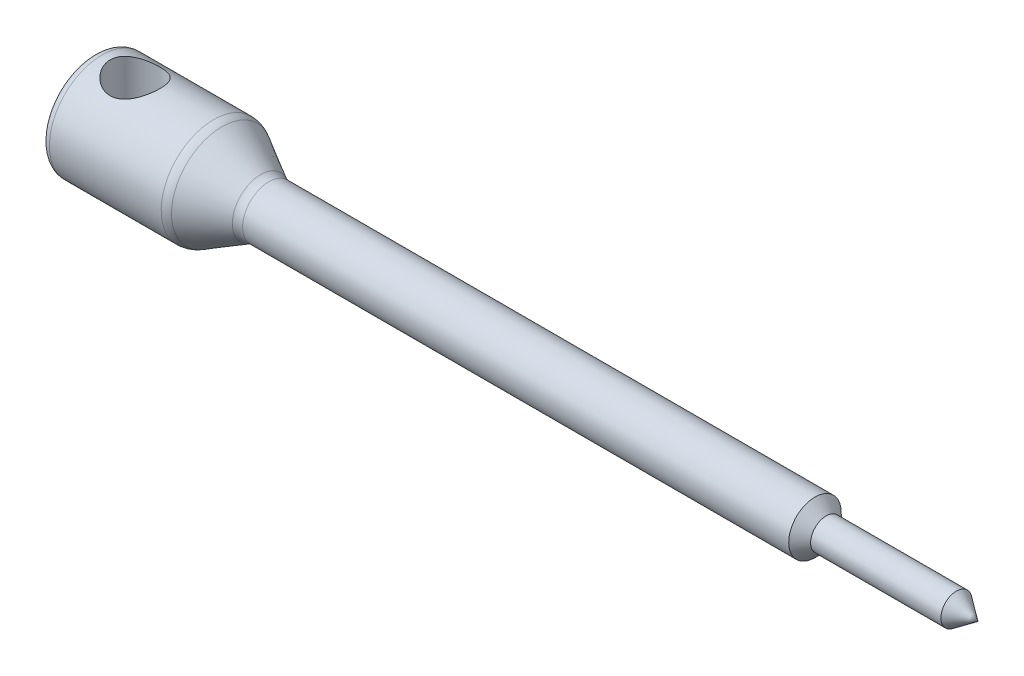
ISO-10303-21;
HEADER;
FILE_DESCRIPTION(('STEP AP214'),'2;1');
FILE_NAME('part.step','',(''),(''),'','','');
FILE_SCHEMA(('AUTOMOTIVE_DESIGN { 1 0 10303 214 1 1 1 1 }'));
ENDSEC;
DATA;
#1=APPLICATION_CONTEXT('core data for automotive mechanical design processes');
#2=APPLICATION_PROTOCOL_DEFINITION('international standard','automotive_design',2000,#1);
#3=PRODUCT_CONTEXT('',#1,'mechanical');
#4=PRODUCT('Part','Part','',(#3));
#5=PRODUCT_RELATED_PRODUCT_CATEGORY('part','',(#4));
#6=PRODUCT_DEFINITION_FORMATION('','',#4);
#7=PRODUCT_DEFINITION_CONTEXT('part definition',#1,'design');
#8=PRODUCT_DEFINITION('design','',#6,#7);
#9=PRODUCT_DEFINITION_SHAPE('','',#8);
#10=(LENGTH_UNIT() NAMED_UNIT(*) SI_UNIT(.MILLI.,.METRE.));
#11=(NAMED_UNIT(*) PLANE_ANGLE_UNIT() SI_UNIT($,.RADIAN.));
#12=(NAMED_UNIT(*) SI_UNIT($,.STERADIAN.) SOLID_ANGLE_UNIT());
#13=UNCERTAINTY_MEASURE_WITH_UNIT(LENGTH_MEASURE(1.E-05),#10,'distance_accuracy_value','');
#14=(GEOMETRIC_REPRESENTATION_CONTEXT(3) GLOBAL_UNCERTAINTY_ASSIGNED_CONTEXT((#13)) GLOBAL_UNIT_ASSIGNED_CONTEXT((#10,
#11,#12)) REPRESENTATION_CONTEXT('',''));
#15=CARTESIAN_POINT('',(0.,0.,0.));
#16=DIRECTION('',(0.,0.,1.));
#17=DIRECTION('',(1.,0.,0.));
#18=AXIS2_PLACEMENT_3D('',#15,#16,#17);
#19=CARTESIAN_POINT('',(106.6,0.,0.));
#20=DIRECTION('',(1.,0.,0.));
#21=DIRECTION('',(0.,1.,0.));
#22=AXIS2_PLACEMENT_3D('',#19,#20,#21);
#23=CYLINDRICAL_SURFACE('',#22,6.325);
#24=CARTESIAN_POINT('',(14.4746490935962,0.,0.));
#25=DIRECTION('',(-1.,0.,0.));
#26=DIRECTION('',(0.,-1.,0.));
#27=AXIS2_PLACEMENT_3D('',#24,#25,#26);
#28=CIRCLE('',#27,6.325);
#29=CARTESIAN_POINT('',(14.4746490935962,-6.325,0.));
#30=VERTEX_POINT('',#29);
#31=EDGE_CURVE('E11',#30,#30,#28,.T.);
#32=ORIENTED_EDGE('',*,*,#31,.T.);
#33=EDGE_LOOP('',(#32));
#34=FACE_BOUND('',#33,.T.);
#35=CARTESIAN_POINT('',(1.,0.,0.));
#36=DIRECTION('',(-1.,0.,0.));
#37=DIRECTION('',(0.,-1.,0.));
#38=AXIS2_PLACEMENT_3D('',#35,#36,#37);
#39=CIRCLE('',#38,6.325);
#40=CARTESIAN_POINT('',(1.,-6.325,0.));
#41=VERTEX_POINT('',#40);
#42=EDGE_CURVE('E89',#41,#41,#39,.F.);
#43=ORIENTED_EDGE('',*,*,#42,.T.);
#44=EDGE_LOOP('',(#43));
#45=FACE_BOUND('',#44,.T.);
#46=CARTESIAN_POINT('',(5.,-5.56826947982944,-3.));
#47=CARTESIAN_POINT('',(4.92119222967104,-5.56827059392074,-2.99999894259012));
#48=CARTESIAN_POINT('',(4.8423674233433,-5.56995022733211,-2.99688818333173));
#49=CARTESIAN_POINT('',(4.68533256394971,-5.57659934100432,-2.98449399086385));
#50=CARTESIAN_POINT('',(4.60712285760096,-5.58157055855336,-2.97520729800386));
#51=CARTESIAN_POINT('',(4.37406418742015,-5.60121077340082,-2.93818095629581));
#52=CARTESIAN_POINT('',(4.22095489226827,-5.62060579276863,-2.90127534083909));
#53=CARTESIAN_POINT('',(3.92468410004388,-5.6692638034737,-2.80497957289879));
#54=CARTESIAN_POINT('',(3.78147784216927,-5.69847834164824,-2.7456996503619));
#55=CARTESIAN_POINT('',(3.50704313818055,-5.76339840148072,-2.6066719292384));
#56=CARTESIAN_POINT('',(3.37581426197858,-5.79910368992877,-2.52692486598507));
#57=CARTESIAN_POINT('',(3.11838132271694,-5.87621576218045,-2.34231156048667));
#58=CARTESIAN_POINT('',(2.99326342353009,-5.91784886026107,-2.23602553085196));
#59=CARTESIAN_POINT('',(2.76179540175121,-6.00028965082854,-2.00431342156703));
#60=CARTESIAN_POINT('',(2.65545387826204,-6.04109695758843,-1.87887862104671));
#61=CARTESIAN_POINT('',(2.45842120369391,-6.12018128310053,-1.60334416695812));
#62=CARTESIAN_POINT('',(2.36902853095926,-6.15816567959753,-1.45222420558039));
#63=CARTESIAN_POINT('',(2.21742304273379,-6.22444335837359,-1.13495446838355));
#64=CARTESIAN_POINT('',(2.15519475287613,-6.25274215612739,-0.968813314772511));
#65=CARTESIAN_POINT('',(2.06386288193791,-6.29483875977189,-0.637685698725659));
#66=CARTESIAN_POINT('',(2.03286625238469,-6.30946080268784,-0.473328463536841));
#67=CARTESIAN_POINT('',(1.99868128341978,-6.32560646409969,-0.141143034605315));
#68=CARTESIAN_POINT('',(1.99547801021746,-6.32713711679121,0.0266832465662504));
#69=CARTESIAN_POINT('',(2.01615387853978,-6.31734976099337,0.346966074304831));
#70=CARTESIAN_POINT('',(2.03792823608613,-6.30703025411388,0.499595554410272));
#71=CARTESIAN_POINT('',(2.10422671587661,-6.27616682010759,0.798730827608391));
#72=CARTESIAN_POINT('',(2.14875252967634,-6.25562213274838,0.945236164498804));
#73=CARTESIAN_POINT('',(2.25968236864464,-6.20584246781492,1.23063265997631));
#74=CARTESIAN_POINT('',(2.32639902524351,-6.17648392957829,1.36937985878915));
#75=CARTESIAN_POINT('',(2.47943819716109,-6.11179613579103,1.63406367426613));
#76=CARTESIAN_POINT('',(2.56576788753176,-6.07646469638256,1.75999557822771));
#77=CARTESIAN_POINT('',(2.76427066135492,-5.99958521327416,2.00718314210621));
#78=CARTESIAN_POINT('',(2.87804137206861,-5.9577637337292,2.12707218128263));
#79=CARTESIAN_POINT('',(3.12385932421293,-5.87470422846713,2.34676308430842));
#80=CARTESIAN_POINT('',(3.25591811580817,-5.83346658977115,2.4465521551271));
#81=CARTESIAN_POINT('',(3.54315872541268,-5.75395600368514,2.62830401957828));
#82=CARTESIAN_POINT('',(3.69919233712724,-5.71595380516626,2.7090502998139));
#83=CARTESIAN_POINT('',(4.02488709858034,-5.65076578326242,2.8425427787134));
#84=CARTESIAN_POINT('',(4.19453514105959,-5.62356970297142,2.89531554513415));
#85=CARTESIAN_POINT('',(4.5289997118452,-5.58587662174924,2.96734767561627));
#86=CARTESIAN_POINT('',(4.69320431620829,-5.57426803608066,2.98884830804172));
#87=CARTESIAN_POINT('',(5.02324984478771,-5.5658799958538,3.0044480969795));
#88=CARTESIAN_POINT('',(5.18908980006437,-5.56909223162059,2.99856260820962));
#89=CARTESIAN_POINT('',(5.50122605010283,-5.58881180328484,2.96161295038339));
#90=CARTESIAN_POINT('',(5.64789964097414,-5.60404769648067,2.93295494845039));
#91=CARTESIAN_POINT('',(5.9341334480049,-5.644300124394,2.85471913635692));
#92=CARTESIAN_POINT('',(6.07369160588337,-5.66931947122875,2.80513531103538));
#93=CARTESIAN_POINT('',(6.34902070999583,-5.72769745099554,2.68399142659994));
#94=CARTESIAN_POINT('',(6.48431830405433,-5.76138813885599,2.61152137333991));
#95=CARTESIAN_POINT('',(6.74158315374771,-5.83296135507246,2.44748641547256));
#96=CARTESIAN_POINT('',(6.86354369375344,-5.87084597606294,2.35591195805711));
#97=CARTESIAN_POINT('',(7.10482182301408,-5.95160212866338,2.14435001701812));
#98=CARTESIAN_POINT('',(7.22234194249414,-5.99456026656037,2.02233658866698));
#99=CARTESIAN_POINT('',(7.43572594154971,-6.07689765760572,1.75951528411057));
#100=CARTESIAN_POINT('',(7.53158469974223,-6.11627606308742,1.61870297578957));
#101=CARTESIAN_POINT('',(7.70016980839589,-6.18794082486986,1.31877084024751));
#102=CARTESIAN_POINT('',(7.77247318100967,-6.22009458943288,1.15937944435881));
#103=CARTESIAN_POINT('',(7.88856776697291,-6.27269871970996,0.828739132863058));
#104=CARTESIAN_POINT('',(7.93238147081069,-6.2931583155585,0.657499688866359));
#105=CARTESIAN_POINT('',(7.98684330765157,-6.31872953003334,0.323827411524828));
#106=CARTESIAN_POINT('',(8.00000574668265,-6.32500334618504,0.161892570167804));
#107=CARTESIAN_POINT('',(7.99999425398486,-6.32499665430743,-0.161954081571034));
#108=CARTESIAN_POINT('',(7.98682778594961,-6.31871970415749,-0.323865885471267));
#109=CARTESIAN_POINT('',(7.93627602883782,-6.29498930664524,-0.633692315519093));
#110=CARTESIAN_POINT('',(7.9002709682672,-6.27817342180405,-0.781885743577601));
#111=CARTESIAN_POINT('',(7.80680442790054,-6.23554743092223,-1.06994859736248));
#112=CARTESIAN_POINT('',(7.74933955680514,-6.20973590334094,-1.20981670338353));
#113=CARTESIAN_POINT('',(7.61181180518672,-6.15005522255023,-1.48426989111478));
#114=CARTESIAN_POINT('',(7.53084894244308,-6.11587592942774,-1.6183345797961));
#115=CARTESIAN_POINT('',(7.3497897808953,-6.0432002838394,-1.87156021352395));
#116=CARTESIAN_POINT('',(7.24968477148527,-6.00470196931824,-1.99071433254137));
#117=CARTESIAN_POINT('',(7.02268724281229,-5.92323064689877,-2.22200871337881));
#118=CARTESIAN_POINT('',(6.89419299061268,-5.88016723357338,-2.33254702006946));
#119=CARTESIAN_POINT('',(6.61947312884743,-5.79751874033787,-2.53100624303766));
#120=CARTESIAN_POINT('',(6.47323445105551,-5.75793626148665,-2.61891033933674));
#121=CARTESIAN_POINT('',(6.24184842402669,-5.70456145379904,-2.73228661775989));
#122=CARTESIAN_POINT('',(6.16193833942879,-5.68764521759227,-2.76722730365996));
#123=CARTESIAN_POINT('',(5.998919126808,-5.65659583143465,-2.83015556897132));
#124=CARTESIAN_POINT('',(5.91581165684595,-5.6424612616503,-2.85814669753253));
#125=CARTESIAN_POINT('',(5.7472232882831,-5.61756472370398,-2.90677436061479));
#126=CARTESIAN_POINT('',(5.66174920835035,-5.60679398136672,-2.92743004847765));
#127=CARTESIAN_POINT('',(5.48897911797295,-5.58903897873491,-2.96118815374418));
#128=CARTESIAN_POINT('',(5.40168447372224,-5.58205197819102,-2.97429603783074));
#129=CARTESIAN_POINT('',(5.261817417597,-5.57417824399279,-2.9890126618239));
#130=CARTESIAN_POINT('',(5.20956869135898,-5.57196614417567,-2.99313013945517));
#131=CARTESIAN_POINT('',(5.10488249811636,-5.56901135292521,-2.99862423213567));
#132=CARTESIAN_POINT('',(5.05244502137411,-5.56826873842358,-3.00000070368549));
#133=CARTESIAN_POINT('',(5.,-5.56826947982944,-3.));
#134=B_SPLINE_CURVE_WITH_KNOTS('',3,(#46,#47,#48,#49,#50,#51,#52,#53,#54,#55,#56,#57,#58,#59,
#60,#61,#62,#63,#64,#65,#66,#67,#68,#69,#70,#71,#72,#73,#74,#75,#76,#77,#78,#79,#80,#81,#82,#83,
#84,#85,#86,#87,#88,#89,#90,#91,#92,#93,#94,#95,#96,#97,#98,#99,#100,#101,#102,#103,#104,#105,
#106,#107,#108,#109,#110,#111,#112,#113,#114,#115,#116,#117,#118,#119,#120,#121,#122,#123,#124,
#125,#126,#127,#128,#129,#130,#131,#132,#133),.UNSPECIFIED.,.T.,.F.,(4,2,2,2,2,2,2,2,2,2,2,2,2,
2,2,2,2,2,2,2,2,2,2,2,2,2,2,2,2,2,2,2,2,2,2,2,2,2,2,2,2,2,2,4),(0.,0.23636561517253,
0.472856082954266,0.946337594194861,1.41751625661757,1.88867799313591,2.39462310052555,
2.90079932028096,3.43692840139747,3.9727516732838,4.4736852685099,4.97434968786119,
5.43573919158286,5.89716300429919,6.36538417920483,6.83377692045143,7.34303611918456,
7.85261842908479,8.38905438552313,8.92497994659177,9.42019481438097,9.91513206096266,
10.3637831055551,10.8125632035357,11.2820905099279,11.7518531600233,12.2737820077344,
12.7958341259675,13.3268011505475,13.8573485053749,14.3425559887278,14.8276259454222,
15.2858589991811,15.7441644982919,16.2230789701406,16.7022118921722,17.2245602934014,
17.7472957501571,18.0135091811639,18.2795863755915,18.5449636256192,18.8101484270879,
18.967436861503,19.1247335301955),.UNSPECIFIED.);
#135=CARTESIAN_POINT('',(5.,-5.56826947982944,-3.));
#136=VERTEX_POINT('',#135);
#137=EDGE_CURVE('E128',#136,#136,#134,.T.);
#138=ORIENTED_EDGE('',*,*,#137,.T.);
#139=EDGE_LOOP('',(#138));
#140=FACE_BOUND('',#139,.T.);
#141=CARTESIAN_POINT('',(2.,6.325,0.));
#142=CARTESIAN_POINT('',(2.00000101495922,6.32499921054987,-0.07937328583606));
#143=CARTESIAN_POINT('',(2.00315616500706,6.32350063537498,-0.158762274405508));
#144=CARTESIAN_POINT('',(2.01573152342123,6.31755171365224,-0.31694302465793));
#145=CARTESIAN_POINT('',(2.02515495176933,6.31309985001873,-0.395734458329656));
#146=CARTESIAN_POINT('',(2.06274328864522,6.29543998740824,-0.630563530451089));
#147=CARTESIAN_POINT('',(2.10022601987851,6.27792800725696,-0.784905940155577));
#148=CARTESIAN_POINT('',(2.19820364720494,6.23328312699633,-1.08380902595234));
#149=CARTESIAN_POINT('',(2.258612327413,6.20618629753549,-1.22840398831555));
#150=CARTESIAN_POINT('',(2.40030961989093,6.14491141751232,-1.50525386061078));
#151=CARTESIAN_POINT('',(2.48159516207826,6.1107344082807,-1.63751058106886));
#152=CARTESIAN_POINT('',(2.66795701925113,6.03625383618954,-1.89423559545804));
#153=CARTESIAN_POINT('',(2.77411144503212,5.99571424981955,-2.01785184257788));
#154=CARTESIAN_POINT('',(3.00485826777346,5.91392876173544,-2.24628973254667));
#155=CARTESIAN_POINT('',(3.12946311806683,5.87268239973268,-2.35109857460012));
#156=CARTESIAN_POINT('',(3.40390384238563,5.79093548110996,-2.54610148878998));
#157=CARTESIAN_POINT('',(3.55487865679303,5.75067590563505,-2.63481919590593));
#158=CARTESIAN_POINT('',(3.79232351265093,5.69720377714499,-2.74758542527731));
#159=CARTESIAN_POINT('',(3.87333262498362,5.68052796563149,-2.78179755873313));
#160=CARTESIAN_POINT('',(4.03851082135988,5.65008974824633,-2.84311152705235));
#161=CARTESIAN_POINT('',(4.12267809015688,5.63632569806092,-2.87021737701754));
#162=CARTESIAN_POINT('',(4.28872255163548,5.61294652033182,-2.91565996550161));
#163=CARTESIAN_POINT('',(4.37046155709498,5.60314131539768,-2.9344047536129));
#164=CARTESIAN_POINT('',(4.53551938204417,5.58700514058788,-2.96501236144485));
#165=CARTESIAN_POINT('',(4.61883737983741,5.58067241237926,-2.97687866434861));
#166=CARTESIAN_POINT('',(4.78634271946731,5.57174036269458,-2.99356430842584));
#167=CARTESIAN_POINT('',(4.87052963290727,5.56913928241007,-2.99838696944335));
#168=CARTESIAN_POINT('',(5.03901481625039,5.56776703011237,-3.00093114109715));
#169=CARTESIAN_POINT('',(5.12331307677214,5.56899555374532,-2.99865321604527));
#170=CARTESIAN_POINT('',(5.35758013660381,5.57772992265056,-2.98240817484294));
#171=CARTESIAN_POINT('',(5.50693930410414,5.58942032616689,-2.96064281095207));
#172=CARTESIAN_POINT('',(5.79946528752883,5.62348263868996,-2.89540594871321));
#173=CARTESIAN_POINT('',(5.94263042298308,5.64585742684652,-2.85192859943351));
#174=CARTESIAN_POINT('',(6.22284238788815,5.69926319319761,-2.74367138632386));
#175=CARTESIAN_POINT('',(6.35967030376834,5.73048289925907,-2.67842083890667));
#176=CARTESIAN_POINT('',(6.62105093601606,5.79805556291057,-2.52881460000707));
#177=CARTESIAN_POINT('',(6.745598202297,5.83441078235834,-2.44445048030632));
#178=CARTESIAN_POINT('',(6.99365464386333,5.9131145898616,-2.24791252177869));
#179=CARTESIAN_POINT('',(7.11546807197926,5.95567711073127,-2.13367701576747));
#180=CARTESIAN_POINT('',(7.33887108019237,6.03863976360999,-1.88613177624688));
#181=CARTESIAN_POINT('',(7.44045277505848,6.07903904803931,-1.75281464040968));
#182=CARTESIAN_POINT('',(7.62407270985824,6.15500803288284,-1.46442333675612));
#183=CARTESIAN_POINT('',(7.70522408295291,6.19033658769695,-1.30871596562321));
#184=CARTESIAN_POINT('',(7.8395553892661,6.25020517847367,-0.983754466666571));
#185=CARTESIAN_POINT('',(7.89275539374979,6.27475295379323,-0.814510160321685));
#186=CARTESIAN_POINT('',(7.96567052832049,6.30871422860522,-0.481264133657539));
#187=CARTESIAN_POINT('',(7.98764848436719,6.31914748472658,-0.317862112465461));
#188=CARTESIAN_POINT('',(8.0044799188396,6.32712085065144,0.0106208024948185));
#189=CARTESIAN_POINT('',(7.99934441723275,6.32466619860608,0.175700986967558));
#190=CARTESIAN_POINT('',(7.96351740046221,6.30776099534971,0.490932176851729));
#191=CARTESIAN_POINT('',(7.93459072837709,6.29413905953025,0.641334091225897));
#192=CARTESIAN_POINT('',(7.85466768972812,6.25727572263287,0.934891454392057));
#193=CARTESIAN_POINT('',(7.80366877465421,6.23403321075546,1.07804606426162));
#194=CARTESIAN_POINT('',(7.67954323153749,6.17919004017601,1.35801790632853));
#195=CARTESIAN_POINT('',(7.60579279175533,6.1473574086089,1.49451155811569));
#196=CARTESIAN_POINT('',(7.43894236599483,6.07851077391321,1.75366442375865));
#197=CARTESIAN_POINT('',(7.34583389688093,6.04149450152289,1.87631753589401));
#198=CARTESIAN_POINT('',(7.133168910347,5.96200056350037,2.11601571661925));
#199=CARTESIAN_POINT('',(7.01198380312117,5.91933151049151,2.23155556216531));
#200=CARTESIAN_POINT('',(6.75163263228626,5.83597829959665,2.44125850892367));
#201=CARTESIAN_POINT('',(6.61245721112641,5.79529518996547,2.53541041455941));
#202=CARTESIAN_POINT('',(6.31361783408067,5.71923443822342,2.70273043671851));
#203=CARTESIAN_POINT('',(6.15339850976286,5.68409906958169,2.77502600142352));
#204=CARTESIAN_POINT('',(5.82084631774221,5.62607963345705,2.89086823854941));
#205=CARTESIAN_POINT('',(5.6485276340492,5.60318148293857,2.93444797171417));
#206=CARTESIAN_POINT('',(5.31365007097895,5.57483397381238,2.98792303183246));
#207=CARTESIAN_POINT('',(5.15164639875423,5.56797639828486,3.00054213984495));
#208=CARTESIAN_POINT('',(4.82778091895189,5.56858156250485,2.9994225916428));
#209=CARTESIAN_POINT('',(4.66591908297926,5.57603986861128,2.98569209592382));
#210=CARTESIAN_POINT('',(4.36010191642111,5.60300296768132,2.93473990028628));
#211=CARTESIAN_POINT('',(4.21573230320013,5.62152700143465,2.89942581708128));
#212=CARTESIAN_POINT('',(3.93505413850971,5.6674982341567,2.80849930713924));
#213=CARTESIAN_POINT('',(3.79874803506356,5.69494812668635,2.75288075248913));
#214=CARTESIAN_POINT('',(3.52805556671751,5.75792936593568,2.61872212533421));
#215=CARTESIAN_POINT('',(3.39440415219412,5.79387773243907,2.53890024838445));
#216=CARTESIAN_POINT('',(3.14155507604513,5.86897262427893,2.36012226089958));
#217=CARTESIAN_POINT('',(3.02236442055091,5.90812068459247,2.26115693526748));
#218=CARTESIAN_POINT('',(2.78885361457309,5.99012595815152,2.0346980743859));
#219=CARTESIAN_POINT('',(2.67635931387515,6.03294096928713,1.90530007407234));
#220=CARTESIAN_POINT('',(2.47433833731994,6.11359076968122,1.62800810323697));
#221=CARTESIAN_POINT('',(2.38482283230134,6.15142313235565,1.48010518856395));
#222=CARTESIAN_POINT('',(2.27029971097628,6.20126841880405,1.24748319611567));
#223=CARTESIAN_POINT('',(2.2354371234724,6.21672332071643,1.16821591170853));
#224=CARTESIAN_POINT('',(2.17257175193905,6.24493245782113,1.00655655346354));
#225=CARTESIAN_POINT('',(2.14456562823048,6.25768800741464,0.924166023586352));
#226=CARTESIAN_POINT('',(2.09579531287352,6.28009258093229,0.757071001051431));
#227=CARTESIAN_POINT('',(2.0750145571098,6.28974870630825,0.672372287494199));
#228=CARTESIAN_POINT('',(2.04088142249416,6.30569412533461,0.501220438604927));
#229=CARTESIAN_POINT('',(2.02752420932811,6.31198560998483,0.41476848312294));
#230=CARTESIAN_POINT('',(2.01198725877617,6.31932115504729,0.273451008841696));
#231=CARTESIAN_POINT('',(2.00749482184513,6.32144803339127,0.218883750436739));
#232=CARTESIAN_POINT('',(2.00150080844935,6.32428774424899,0.109546823947194));
#233=CARTESIAN_POINT('',(1.99999929955559,6.32500054481591,0.0547771513176751));
#234=CARTESIAN_POINT('',(2.,6.325,0.));
#235=B_SPLINE_CURVE_WITH_KNOTS('',3,(#141,#142,#143,#144,#145,#146,#147,#148,#149,#150,#151,
#152,#153,#154,#155,#156,#157,#158,#159,#160,#161,#162,#163,#164,#165,#166,#167,#168,#169,#170,
#171,#172,#173,#174,#175,#176,#177,#178,#179,#180,#181,#182,#183,#184,#185,#186,#187,#188,#189,
#190,#191,#192,#193,#194,#195,#196,#197,#198,#199,#200,#201,#202,#203,#204,#205,#206,#207,#208,
#209,#210,#211,#212,#213,#214,#215,#216,#217,#218,#219,#220,#221,#222,#223,#224,#225,#226,#227,
#228,#229,#230,#231,#232,#233,#234),.UNSPECIFIED.,.T.,.F.,(4,2,2,2,2,2,2,2,2,2,2,2,2,2,2,2,2,2,
2,2,2,2,2,2,2,2,2,2,2,2,2,2,2,2,2,2,2,2,2,2,2,2,2,2,2,2,4),(0.,0.238061711995977,
0.476245809586168,0.95305791656634,1.42809440052183,1.90306106713573,2.4046497721108,
2.9065785867478,3.44260246693829,3.71080289663289,3.97885146295571,4.23179643176775,
4.48461320010641,4.73731077110231,4.98998825972909,5.44182643516032,5.89378643740736,
6.35622878305538,6.81887544305785,7.3336121916173,7.84854916571078,8.38300710737338,
8.91708074015982,9.41003253065641,9.90278398173288,10.3619666330092,10.8212023166815,
11.29435678893,11.7677190470957,12.2838036112782,12.8001577020385,13.3350096219711,
13.8692446820868,14.3544617265665,14.839528523148,15.2869159432452,15.7344384971598,
16.2118217775178,16.6894354306873,17.2172044238399,17.7452295011152,18.0088189159429,
18.2722796837933,18.5351324241611,18.7978137899978,18.9621014049871,19.1263927315158),.UNSPECIFIED.);
#236=CARTESIAN_POINT('',(2.,6.325,0.));
#237=VERTEX_POINT('',#236);
#238=EDGE_CURVE('E124',#237,#237,#235,.T.);
#239=ORIENTED_EDGE('',*,*,#238,.T.);
#240=EDGE_LOOP('',(#239));
#241=FACE_BOUND('',#240,.T.);
#242=ADVANCED_FACE('F32',(#34,#45,#140,#241),#23,.T.);
#243=CARTESIAN_POINT('',(106.6,0.,0.));
#244=DIRECTION('',(-1.,0.,0.));
#245=DIRECTION('',(0.,-1.,0.));
#246=AXIS2_PLACEMENT_3D('',#243,#244,#245);
#247=CONICAL_SURFACE('',#246,0.,0.624782546501608);
#248=CARTESIAN_POINT('',(104.,0.,0.));
#249=DIRECTION('',(1.,0.,0.));
#250=DIRECTION('',(0.,1.,0.));
#251=AXIS2_PLACEMENT_3D('',#248,#249,#250);
#252=CIRCLE('',#251,1.875);
#253=CARTESIAN_POINT('',(104.,1.875,0.));
#254=VERTEX_POINT('',#253);
#255=EDGE_CURVE('E121',#254,#254,#252,.T.);
#256=ORIENTED_EDGE('',*,*,#255,.T.);
#257=EDGE_LOOP('',(#256));
#258=FACE_BOUND('',#257,.T.);
#259=CARTESIAN_POINT('',(106.6,0.,0.));
#260=VERTEX_POINT('',#259);
#261=VERTEX_LOOP('',#260);
#262=FACE_BOUND('',#261,.T.);
#263=ADVANCED_FACE('F47',(#258,#262),#247,.T.);
#264=CARTESIAN_POINT('',(106.6,0.,0.));
#265=DIRECTION('',(1.,0.,0.));
#266=DIRECTION('',(0.,1.,0.));
#267=AXIS2_PLACEMENT_3D('',#264,#265,#266);
#268=CYLINDRICAL_SURFACE('',#267,1.875);
#269=CARTESIAN_POINT('',(88.3,0.,0.));
#270=DIRECTION('',(1.,0.,0.));
#271=DIRECTION('',(0.,1.,0.));
#272=AXIS2_PLACEMENT_3D('',#269,#270,#271);
#273=CIRCLE('',#272,1.875);
#274=CARTESIAN_POINT('',(88.3,1.875,0.));
#275=VERTEX_POINT('',#274);
#276=EDGE_CURVE('E120',#275,#275,#273,.T.);
#277=ORIENTED_EDGE('',*,*,#276,.T.);
#278=EDGE_LOOP('',(#277));
#279=FACE_BOUND('',#278,.T.);
#280=ORIENTED_EDGE('',*,*,#255,.F.);
#281=EDGE_LOOP('',(#280));
#282=FACE_BOUND('',#281,.T.);
#283=ADVANCED_FACE('F49',(#279,#282),#268,.T.);
#284=CARTESIAN_POINT('',(88.3,0.,0.));
#285=DIRECTION('',(-1.,0.,0.));
#286=DIRECTION('',(0.,-1.,0.));
#287=AXIS2_PLACEMENT_3D('',#284,#285,#286);
#288=CONICAL_SURFACE('',#287,1.875,0.762674802555803);
#289=CARTESIAN_POINT('',(86.95,0.,0.));
#290=DIRECTION('',(1.,0.,0.));
#291=DIRECTION('',(0.,1.,0.));
#292=AXIS2_PLACEMENT_3D('',#289,#290,#291);
#293=CIRCLE('',#292,3.16499999999999);
#294=CARTESIAN_POINT('',(86.95,3.16499999999999,0.));
#295=VERTEX_POINT('',#294);
#296=EDGE_CURVE('E117',#295,#295,#293,.T.);
#297=ORIENTED_EDGE('',*,*,#296,.T.);
#298=EDGE_LOOP('',(#297));
#299=FACE_BOUND('',#298,.T.);
#300=ORIENTED_EDGE('',*,*,#276,.F.);
#301=EDGE_LOOP('',(#300));
#302=FACE_BOUND('',#301,.T.);
#303=ADVANCED_FACE('F56',(#299,#302),#288,.T.);
#304=CARTESIAN_POINT('',(106.6,0.,0.));
#305=DIRECTION('',(1.,0.,0.));
#306=DIRECTION('',(0.,1.,0.));
#307=AXIS2_PLACEMENT_3D('',#304,#305,#306);
#308=CYLINDRICAL_SURFACE('',#307,3.16499999999999);
#309=CARTESIAN_POINT('',(21.1253509064038,0.,0.));
#310=DIRECTION('',(1.,0.,0.));
#311=DIRECTION('',(0.,1.,0.));
#312=AXIS2_PLACEMENT_3D('',#309,#310,#311);
#313=CIRCLE('',#312,3.16499999999999);
#314=CARTESIAN_POINT('',(21.1253509064038,3.16499999999999,0.));
#315=VERTEX_POINT('',#314);
#316=EDGE_CURVE('E81',#315,#315,#313,.T.);
#317=ORIENTED_EDGE('',*,*,#316,.T.);
#318=EDGE_LOOP('',(#317));
#319=FACE_BOUND('',#318,.T.);
#320=ORIENTED_EDGE('',*,*,#296,.F.);
#321=EDGE_LOOP('',(#320));
#322=FACE_BOUND('',#321,.T.);
#323=ADVANCED_FACE('F98',(#319,#322),#308,.T.);
#324=CARTESIAN_POINT('',(20.6,0.,0.));
#325=DIRECTION('',(-1.,0.,0.));
#326=DIRECTION('',(0.,-1.,0.));
#327=AXIS2_PLACEMENT_3D('',#324,#325,#326);
#328=CONICAL_SURFACE('',#327,3.16499999999999,0.513744932201711);
#329=CARTESIAN_POINT('',(20.1424665363382,0.,0.));
#330=DIRECTION('',(-1.,0.,0.));
#331=DIRECTION('',(0.,-1.,0.));
#332=AXIS2_PLACEMENT_3D('',#329,#330,#331);
#333=CIRCLE('',#332,3.42317959735204);
#334=CARTESIAN_POINT('',(20.1424665363382,-3.42317959735204,0.));
#335=VERTEX_POINT('',#334);
#336=EDGE_CURVE('E44',#335,#335,#333,.T.);
#337=ORIENTED_EDGE('',*,*,#336,.T.);
#338=EDGE_LOOP('',(#337));
#339=FACE_BOUND('',#338,.T.);
#340=CARTESIAN_POINT('',(15.4575334636619,0.,0.));
#341=DIRECTION('',(1.,0.,0.));
#342=DIRECTION('',(0.,1.,0.));
#343=AXIS2_PLACEMENT_3D('',#340,#341,#342);
#344=CIRCLE('',#343,6.06682040264795);
#345=CARTESIAN_POINT('',(15.4575334636619,6.06682040264795,0.));
#346=VERTEX_POINT('',#345);
#347=EDGE_CURVE('E83',#346,#346,#344,.T.);
#348=ORIENTED_EDGE('',*,*,#347,.T.);
#349=EDGE_LOOP('',(#348));
#350=FACE_BOUND('',#349,.T.);
#351=ADVANCED_FACE('F94',(#339,#350),#328,.T.);
#352=CARTESIAN_POINT('',(0.,0.,0.));
#353=DIRECTION('',(-1.,0.,0.));
#354=DIRECTION('',(0.,-1.,0.));
#355=AXIS2_PLACEMENT_3D('',#352,#353,#354);
#356=PLANE('',#355);
#357=CARTESIAN_POINT('',(0.,0.,0.));
#358=DIRECTION('',(-1.,0.,0.));
#359=DIRECTION('',(0.,-1.,0.));
#360=AXIS2_PLACEMENT_3D('',#357,#358,#359);
#361=CIRCLE('',#360,1.5);
#362=CARTESIAN_POINT('',(0.,-1.5,0.));
#363=VERTEX_POINT('',#362);
#364=EDGE_CURVE('E150',#363,#363,#361,.T.);
#365=ORIENTED_EDGE('',*,*,#364,.F.);
#366=EDGE_LOOP('',(#365));
#367=FACE_BOUND('',#366,.T.);
#368=CARTESIAN_POINT('',(0.,0.,0.));
#369=DIRECTION('',(-1.,0.,0.));
#370=DIRECTION('',(0.,-1.,0.));
#371=AXIS2_PLACEMENT_3D('',#368,#369,#370);
#372=CIRCLE('',#371,5.325);
#373=CARTESIAN_POINT('',(0.,-5.325,0.));
#374=VERTEX_POINT('',#373);
#375=EDGE_CURVE('E84',#374,#374,#372,.T.);
#376=ORIENTED_EDGE('',*,*,#375,.T.);
#377=EDGE_LOOP('',(#376));
#378=FACE_BOUND('',#377,.T.);
#379=ADVANCED_FACE('F97',(#367,#378),#356,.T.);
#380=CARTESIAN_POINT('',(5.,10.,0.));
#381=DIRECTION('',(0.,-1.,0.));
#382=DIRECTION('',(0.,0.,-1.));
#383=AXIS2_PLACEMENT_3D('',#380,#381,#382);
#384=CYLINDRICAL_SURFACE('',#383,3.);
#385=CARTESIAN_POINT('',(2.,-1.5,0.));
#386=CARTESIAN_POINT('',(2.00000429892438,-1.49999504652421,-0.0788579444268502));
#387=CARTESIAN_POINT('',(2.00314263470365,-1.49374489031842,-0.157809899546344));
#388=CARTESIAN_POINT('',(2.01538765944264,-1.46902067948769,-0.313380352903344));
#389=CARTESIAN_POINT('',(2.0245056825662,-1.45052341050328,-0.389994130070445));
#390=CARTESIAN_POINT('',(2.04775580894937,-1.40220928707506,-0.538400317320674));
#391=CARTESIAN_POINT('',(2.06186841233694,-1.37243642362805,-0.61021020440872));
#392=CARTESIAN_POINT('',(2.09381335226358,-1.30264406795252,-0.747708925209898));
#393=CARTESIAN_POINT('',(2.11164539549712,-1.2626253836267,-0.813398240985089));
#394=CARTESIAN_POINT('',(2.15065612612907,-1.17072412577207,-0.941261726642864));
#395=CARTESIAN_POINT('',(2.17197201308694,-1.11827028114054,-1.00298281668316));
#396=CARTESIAN_POINT('',(2.21510044629885,-1.00421778112944,-1.11716916730047));
#397=CARTESIAN_POINT('',(2.23691335686448,-0.942612222341338,-1.16962737466015));
#398=CARTESIAN_POINT('',(2.28051573203979,-0.806274975714928,-1.26787800067542));
#399=CARTESIAN_POINT('',(2.30217219544802,-0.730895852481131,-1.31283800332746));
#400=CARTESIAN_POINT('',(2.34071031841519,-0.572448996020678,-1.38925234033604));
#401=CARTESIAN_POINT('',(2.35759538589515,-0.489386806915876,-1.4207163224495));
#402=CARTESIAN_POINT('',(2.38313199443287,-0.323002341867116,-1.46719866328288));
#403=CARTESIAN_POINT('',(2.39221592624429,-0.239993321898909,-1.48308878562066));
#404=CARTESIAN_POINT('',(2.40227165077208,-0.0720317433307844,-1.50064048996327));
#405=CARTESIAN_POINT('',(2.40325145985068,0.0129188113067325,-1.50231613255961));
#406=CARTESIAN_POINT('',(2.39733604614127,0.171429036473053,-1.49203093075844));
#407=CARTESIAN_POINT('',(2.39136854506979,0.245136046834576,-1.48167683930523));
#408=CARTESIAN_POINT('',(2.37385656899224,0.389582864059563,-1.4504097735854));
#409=CARTESIAN_POINT('',(2.36231031752335,0.460321717957974,-1.42949343584648));
#410=CARTESIAN_POINT('',(2.33468785380888,0.598843698848489,-1.37731467057901));
#411=CARTESIAN_POINT('',(2.31851239004002,0.666519598178683,-1.34582260067399));
#412=CARTESIAN_POINT('',(2.28344893577894,0.795951438885012,-1.273562531502));
#413=CARTESIAN_POINT('',(2.26455972829714,0.857704703400134,-1.2327903657187));
#414=CARTESIAN_POINT('',(2.22330263145071,0.98178187911484,-1.13709908236918));
#415=CARTESIAN_POINT('',(2.20079734644881,1.04318531036424,-1.08104168755392));
#416=CARTESIAN_POINT('',(2.15678565049389,1.15610312788635,-0.95933336811206));
#417=CARTESIAN_POINT('',(2.13527972061798,1.20761278805082,-0.893677884861428));
#418=CARTESIAN_POINT('',(2.09447019075554,1.30152849154459,-0.750774758747773));
#419=CARTESIAN_POINT('',(2.07531523756989,1.34340070866861,-0.673130387399113));
#420=CARTESIAN_POINT('',(2.04263178318136,1.41314554356451,-0.510699323233195));
#421=CARTESIAN_POINT('',(2.0290988158467,1.44102927752275,-0.425918364397914));
#422=CARTESIAN_POINT('',(2.01013499387847,1.47971310557502,-0.259149737491053));
#423=CARTESIAN_POINT('',(2.00412592548035,1.49173685362017,-0.177512295822489));
#424=CARTESIAN_POINT('',(1.99890479811344,1.50219709670173,-0.0131693999240273));
#425=CARTESIAN_POINT('',(1.99968951918022,1.5006400284592,0.0695355298048632));
#426=CARTESIAN_POINT('',(2.00763211619847,1.48468996737188,0.22684945797898));
#427=CARTESIAN_POINT('',(2.01429131467747,1.47130120090501,0.301589112074895));
#428=CARTESIAN_POINT('',(2.03266743027739,1.43364289215732,0.447610338452912));
#429=CARTESIAN_POINT('',(2.04438490498382,1.40937215031976,0.518891528536631));
#430=CARTESIAN_POINT('',(2.07223622879618,1.35000230035045,0.658332912674359));
#431=CARTESIAN_POINT('',(2.08848677345554,1.31461342482557,0.726345595508705));
#432=CARTESIAN_POINT('',(2.12384038523873,1.23433869653015,0.855692042548907));
#433=CARTESIAN_POINT('',(2.14294466649592,1.18944879810691,0.917022944664887));
#434=CARTESIAN_POINT('',(2.18437667995703,1.08635936200393,1.03765153393382));
#435=CARTESIAN_POINT('',(2.20683672734751,1.02728569733228,1.09615811672854));
#436=CARTESIAN_POINT('',(2.2510641258677,0.900112273083408,1.20278448167828));
#437=CARTESIAN_POINT('',(2.27283098899929,0.83200632172812,1.25089707856781));
#438=CARTESIAN_POINT('',(2.31423211690266,0.684534518740536,1.33756187171853));
#439=CARTESIAN_POINT('',(2.33371205616409,0.604783100858278,1.37553824370037));
#440=CARTESIAN_POINT('',(2.36638891558798,0.438734898637551,1.43712423890206));
#441=CARTESIAN_POINT('',(2.37959392667375,0.352446710299665,1.46075237380052));
#442=CARTESIAN_POINT('',(2.39657748461297,0.184634665672944,1.49079253120031));
#443=CARTESIAN_POINT('',(2.40113924802402,0.103448619847137,1.49863949460818));
#444=CARTESIAN_POINT('',(2.40251968037595,-0.0591706007467876,1.5010337315643));
#445=CARTESIAN_POINT('',(2.39934170560415,-0.140603653106793,1.49558676993486));
#446=CARTESIAN_POINT('',(2.38643206923385,-0.293225252300156,1.47288918838996));
#447=CARTESIAN_POINT('',(2.37735358276012,-0.36465070521711,1.45681247151455));
#448=CARTESIAN_POINT('',(2.35443475718521,-0.50371217913655,1.41476303733662));
#449=CARTESIAN_POINT('',(2.34059288645497,-0.571346973138048,1.38878713673988));
#450=CARTESIAN_POINT('',(2.30857204453196,-0.705937276479806,1.32572361795085));
#451=CARTESIAN_POINT('',(2.29016416406119,-0.772541852743543,1.28800670672355));
#452=CARTESIAN_POINT('',(2.25147002547709,-0.898911804271889,1.20322645745609));
#453=CARTESIAN_POINT('',(2.23118279306584,-0.958673595781668,1.15615825686234));
#454=CARTESIAN_POINT('',(2.18806515262862,-1.07721297353201,1.04730498999206));
#455=CARTESIAN_POINT('',(2.16522525040058,-1.13498865352544,0.984426634495891));
#456=CARTESIAN_POINT('',(2.12183371610104,-1.2393944751529,0.849232209349795));
#457=CARTESIAN_POINT('',(2.10128332060707,-1.28601860920486,0.776911084957796));
#458=CARTESIAN_POINT('',(2.06452985650194,-1.36685454406811,0.623897395174419));
#459=CARTESIAN_POINT('',(2.048358552591,-1.4009762538547,0.543149255665096));
#460=CARTESIAN_POINT('',(2.0224798805152,-1.45471225163611,0.37611315170713));
#461=CARTESIAN_POINT('',(2.01275414955398,-1.47436777020857,0.28984169938365));
#462=CARTESIAN_POINT('',(2.00456807129783,-1.49084611662861,0.168902919736342));
#463=CARTESIAN_POINT('',(2.00285951989624,-1.49427396129951,0.135242819162347));
#464=CARTESIAN_POINT('',(2.00057454534777,-1.49885199827113,0.0677275977076368));
#465=CARTESIAN_POINT('',(1.99999815344928,-1.50000212770531,0.0338724714699424));
#466=CARTESIAN_POINT('',(2.,-1.5,0.));
#467=B_SPLINE_CURVE_WITH_KNOTS('',3,(#385,#386,#387,#388,#389,#390,#391,#392,#393,#394,#395,
#396,#397,#398,#399,#400,#401,#402,#403,#404,#405,#406,#407,#408,#409,#410,#411,#412,#413,#414,
#415,#416,#417,#418,#419,#420,#421,#422,#423,#424,#425,#426,#427,#428,#429,#430,#431,#432,#433,
#434,#435,#436,#437,#438,#439,#440,#441,#442,#443,#444,#445,#446,#447,#448,#449,#450,#451,#452,
#453,#454,#455,#456,#457,#458,#459,#460,#461,#462,#463,#464,#465,#466),.UNSPECIFIED.,.T.,.F.,(4,
2,2,2,2,2,2,2,2,2,2,2,2,2,2,2,2,2,2,2,2,2,2,2,2,2,2,2,2,2,2,2,2,2,2,2,2,2,2,2,4),(0.,
0.236436386130439,0.473322224563797,0.709293233238448,0.945245640872352,1.19547263807713,
1.44588935648105,1.71572589646129,1.98536921847421,2.23887018210344,2.49212035993531,
2.71508568613981,2.93812205888518,3.16635360252731,3.39468781890333,3.65197412000818,
3.90938301898029,4.17874533321661,4.44789325368419,4.69474935707018,4.94148846767214,
5.16910359759183,5.39674382446397,5.63089284041848,5.86514176122509,6.12239415966628,
6.37982382923148,6.64972023242589,6.91926767918176,7.1629396125457,7.40650589797017,
7.62686895373284,7.84730293182527,8.08254685170431,8.31791341715446,8.58187864135757,
8.84598575071869,9.1119602049529,9.37717362931724,9.47872920200875,9.58028757766599),.UNSPECIFIED.);
#468=CARTESIAN_POINT('',(2.,-1.5,0.));
#469=VERTEX_POINT('',#468);
#470=EDGE_CURVE('E36',#469,#469,#467,.T.);
#471=ORIENTED_EDGE('',*,*,#470,.F.);
#472=EDGE_LOOP('',(#471));
#473=FACE_BOUND('',#472,.T.);
#474=ORIENTED_EDGE('',*,*,#238,.F.);
#475=EDGE_LOOP('',(#474));
#476=FACE_BOUND('',#475,.T.);
#477=ORIENTED_EDGE('',*,*,#137,.F.);
#478=EDGE_LOOP('',(#477));
#479=FACE_BOUND('',#478,.T.);
#480=ADVANCED_FACE('F67',(#473,#476,#479),#384,.F.);
#481=CARTESIAN_POINT('',(1.,0.,0.));
#482=DIRECTION('',(-1.,0.,0.));
#483=DIRECTION('',(0.,-1.,0.));
#484=AXIS2_PLACEMENT_3D('',#481,#482,#483);
#485=TOROIDAL_SURFACE('',#484,5.325,1.);
#486=ORIENTED_EDGE('',*,*,#375,.F.);
#487=EDGE_LOOP('',(#486));
#488=FACE_BOUND('',#487,.T.);
#489=ORIENTED_EDGE('',*,*,#42,.F.);
#490=EDGE_LOOP('',(#489));
#491=FACE_BOUND('',#490,.T.);
#492=ADVANCED_FACE('F64',(#488,#491),#485,.T.);
#493=CARTESIAN_POINT('',(21.1253509064038,0.,0.));
#494=DIRECTION('',(1.,0.,0.));
#495=DIRECTION('',(0.,1.,0.));
#496=AXIS2_PLACEMENT_3D('',#493,#494,#495);
#497=TOROIDAL_SURFACE('',#496,5.16499999999999,2.);
#498=ORIENTED_EDGE('',*,*,#336,.F.);
#499=EDGE_LOOP('',(#498));
#500=FACE_BOUND('',#499,.T.);
#501=ORIENTED_EDGE('',*,*,#316,.F.);
#502=EDGE_LOOP('',(#501));
#503=FACE_BOUND('',#502,.T.);
#504=ADVANCED_FACE('F66',(#500,#503),#497,.F.);
#505=CARTESIAN_POINT('',(14.4746490935962,0.,0.));
#506=DIRECTION('',(-1.,0.,0.));
#507=DIRECTION('',(0.,-1.,0.));
#508=AXIS2_PLACEMENT_3D('',#505,#506,#507);
#509=TOROIDAL_SURFACE('',#508,4.325,2.);
#510=ORIENTED_EDGE('',*,*,#31,.F.);
#511=EDGE_LOOP('',(#510));
#512=FACE_BOUND('',#511,.T.);
#513=ORIENTED_EDGE('',*,*,#347,.F.);
#514=EDGE_LOOP('',(#513));
#515=FACE_BOUND('',#514,.T.);
#516=ADVANCED_FACE('F34',(#512,#515),#509,.T.);
#517=CARTESIAN_POINT('',(6.,0.,0.));
#518=DIRECTION('',(-1.,0.,0.));
#519=DIRECTION('',(0.,-1.,0.));
#520=AXIS2_PLACEMENT_3D('',#517,#518,#519);
#521=CYLINDRICAL_SURFACE('',#520,1.5);
#522=ORIENTED_EDGE('',*,*,#470,.T.);
#523=EDGE_LOOP('',(#522));
#524=FACE_BOUND('',#523,.T.);
#525=ORIENTED_EDGE('',*,*,#364,.T.);
#526=EDGE_LOOP('',(#525));
#527=FACE_BOUND('',#526,.T.);
#528=ADVANCED_FACE('F74',(#524,#527),#521,.F.);
#529=CLOSED_SHELL('',(#242,#263,#283,#303,#323,#351,#379,#480,#492,#504,#516,#528));
#530=MANIFOLD_SOLID_BREP('B2',#529);
#531=ADVANCED_BREP_SHAPE_REPRESENTATION('',(#18,#530),#14);
#532=SHAPE_DEFINITION_REPRESENTATION(#9,#531);
ENDSEC;
END-ISO-10303-21;
